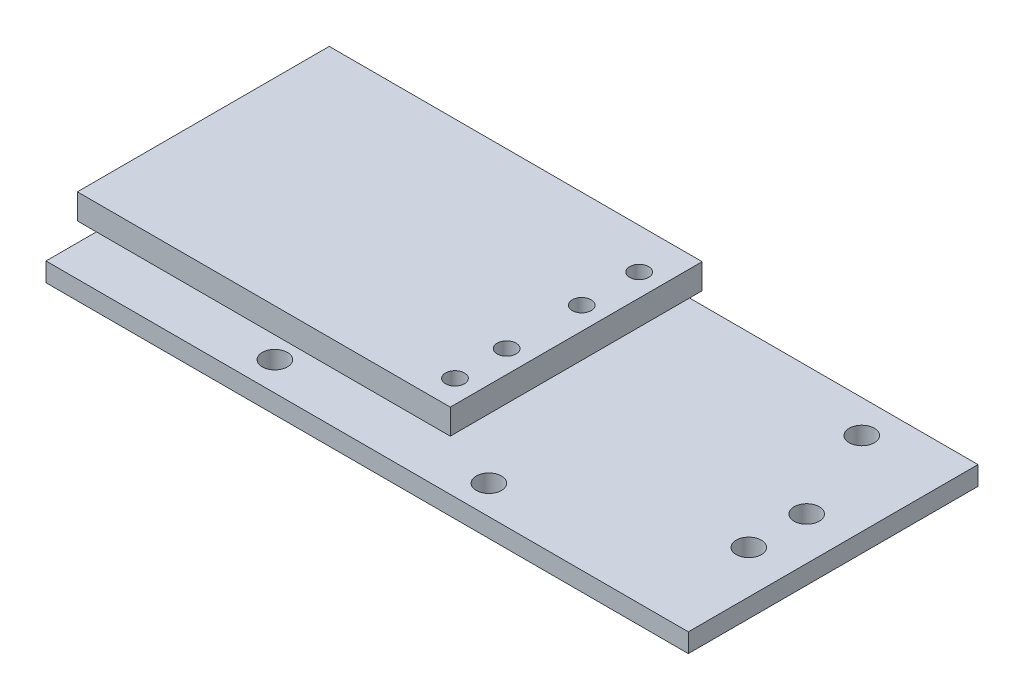
ISO-10303-21;
HEADER;
FILE_DESCRIPTION(('STEP AP214'),'2;1');
FILE_NAME('part.step','',(''),(''),'','','');
FILE_SCHEMA(('AUTOMOTIVE_DESIGN { 1 0 10303 214 1 1 1 1 }'));
ENDSEC;
DATA;
#1=APPLICATION_CONTEXT('core data for automotive mechanical design processes');
#2=APPLICATION_PROTOCOL_DEFINITION('international standard','automotive_design',2000,#1);
#3=PRODUCT_CONTEXT('',#1,'mechanical');
#4=PRODUCT('Part','Part','',(#3));
#5=PRODUCT_RELATED_PRODUCT_CATEGORY('part','',(#4));
#6=PRODUCT_DEFINITION_FORMATION('','',#4);
#7=PRODUCT_DEFINITION_CONTEXT('part definition',#1,'design');
#8=PRODUCT_DEFINITION('design','',#6,#7);
#9=PRODUCT_DEFINITION_SHAPE('','',#8);
#10=(LENGTH_UNIT() NAMED_UNIT(*) SI_UNIT(.MILLI.,.METRE.));
#11=(NAMED_UNIT(*) PLANE_ANGLE_UNIT() SI_UNIT($,.RADIAN.));
#12=(NAMED_UNIT(*) SI_UNIT($,.STERADIAN.) SOLID_ANGLE_UNIT());
#13=UNCERTAINTY_MEASURE_WITH_UNIT(LENGTH_MEASURE(1.E-05),#10,'distance_accuracy_value','');
#14=(GEOMETRIC_REPRESENTATION_CONTEXT(3) GLOBAL_UNCERTAINTY_ASSIGNED_CONTEXT((#13)) GLOBAL_UNIT_ASSIGNED_CONTEXT((#10,
#11,#12)) REPRESENTATION_CONTEXT('',''));
#15=CARTESIAN_POINT('',(0.,0.,0.));
#16=DIRECTION('',(0.,0.,1.));
#17=DIRECTION('',(1.,0.,0.));
#18=AXIS2_PLACEMENT_3D('',#15,#16,#17);
#19=CARTESIAN_POINT('',(0.,1.5,0.));
#20=DIRECTION('',(0.,1.,0.));
#21=DIRECTION('',(0.,0.,1.));
#22=AXIS2_PLACEMENT_3D('',#19,#20,#21);
#23=PLANE('',#22);
#24=CARTESIAN_POINT('',(7.36400767289264,1.5,9.20036926936542));
#25=DIRECTION('',(0.,1.,0.));
#26=DIRECTION('',(0.,0.,1.));
#27=AXIS2_PLACEMENT_3D('',#24,#25,#26);
#28=CIRCLE('',#27,1.);
#29=CARTESIAN_POINT('',(7.36400767289264,1.5,10.2003692693654));
#30=VERTEX_POINT('',#29);
#31=EDGE_CURVE('E201',#30,#30,#28,.T.);
#32=ORIENTED_EDGE('',*,*,#31,.F.);
#33=EDGE_LOOP('',(#32));
#34=FACE_BOUND('',#33,.T.);
#35=CARTESIAN_POINT('',(22.0955755667116,1.5,3.29315640105188));
#36=DIRECTION('',(0.,1.,0.));
#37=DIRECTION('',(0.,0.,1.));
#38=AXIS2_PLACEMENT_3D('',#35,#36,#37);
#39=CIRCLE('',#38,1.);
#40=CARTESIAN_POINT('',(22.0955755667116,1.5,4.29315640105189));
#41=VERTEX_POINT('',#40);
#42=EDGE_CURVE('E213',#41,#41,#39,.T.);
#43=ORIENTED_EDGE('',*,*,#42,.F.);
#44=EDGE_LOOP('',(#43));
#45=FACE_BOUND('',#44,.T.);
#46=CARTESIAN_POINT('',(-18.598557526115,1.5,-8.88591210522416));
#47=DIRECTION('',(0.,1.,0.));
#48=DIRECTION('',(0.,0.,1.));
#49=AXIS2_PLACEMENT_3D('',#46,#47,#48);
#50=CIRCLE('',#49,0.499999999999999);
#51=CARTESIAN_POINT('',(-18.598557526115,1.5,-8.38591210522417));
#52=VERTEX_POINT('',#51);
#53=EDGE_CURVE('E225',#52,#52,#50,.T.);
#54=ORIENTED_EDGE('',*,*,#53,.F.);
#55=EDGE_LOOP('',(#54));
#56=FACE_BOUND('',#55,.T.);
#57=DIRECTION('',(0.,0.,1.));
#58=VECTOR('',#57,1.);
#59=CARTESIAN_POINT('',(-25.5,1.5,-11.5));
#60=LINE('',#59,#58);
#61=CARTESIAN_POINT('',(-25.5,1.5,-11.5));
#62=VERTEX_POINT('',#61);
#63=CARTESIAN_POINT('',(-25.5,1.5,11.5));
#64=VERTEX_POINT('',#63);
#65=EDGE_CURVE('E231',#62,#64,#60,.T.);
#66=ORIENTED_EDGE('',*,*,#65,.T.);
#67=DIRECTION('',(1.,0.,0.));
#68=VECTOR('',#67,1.);
#69=CARTESIAN_POINT('',(-25.5,1.5,11.5));
#70=LINE('',#69,#68);
#71=CARTESIAN_POINT('',(25.5,1.5,11.5));
#72=VERTEX_POINT('',#71);
#73=EDGE_CURVE('E88',#64,#72,#70,.T.);
#74=ORIENTED_EDGE('',*,*,#73,.T.);
#75=DIRECTION('',(0.,0.,-1.));
#76=VECTOR('',#75,1.);
#77=CARTESIAN_POINT('',(25.5,1.5,-11.5));
#78=LINE('',#77,#76);
#79=CARTESIAN_POINT('',(25.5,1.5,-11.5));
#80=VERTEX_POINT('',#79);
#81=EDGE_CURVE('E234',#72,#80,#78,.T.);
#82=ORIENTED_EDGE('',*,*,#81,.T.);
#83=DIRECTION('',(-1.,0.,0.));
#84=VECTOR('',#83,1.);
#85=CARTESIAN_POINT('',(-25.5,1.5,-11.5));
#86=LINE('',#85,#84);
#87=EDGE_CURVE('E60',#80,#62,#86,.T.);
#88=ORIENTED_EDGE('',*,*,#87,.T.);
#89=EDGE_LOOP('',(#66,#74,#82,#88));
#90=FACE_BOUND('',#89,.T.);
#91=CARTESIAN_POINT('',(18.8867191938005,1.5,-8.88591210522416));
#92=DIRECTION('',(0.,1.,0.));
#93=DIRECTION('',(0.,0.,1.));
#94=AXIS2_PLACEMENT_3D('',#91,#92,#93);
#95=CIRCLE('',#94,1.);
#96=CARTESIAN_POINT('',(18.8867191938005,1.5,-7.88591210522416));
#97=VERTEX_POINT('',#96);
#98=EDGE_CURVE('E219',#97,#97,#95,.T.);
#99=ORIENTED_EDGE('',*,*,#98,.F.);
#100=EDGE_LOOP('',(#99));
#101=FACE_BOUND('',#100,.T.);
#102=CARTESIAN_POINT('',(22.0955755667116,1.5,-1.3013424965253));
#103=DIRECTION('',(0.,1.,0.));
#104=DIRECTION('',(0.,0.,1.));
#105=AXIS2_PLACEMENT_3D('',#102,#103,#104);
#106=CIRCLE('',#105,1.);
#107=CARTESIAN_POINT('',(22.0955755667116,1.5,-0.301342496525302));
#108=VERTEX_POINT('',#107);
#109=EDGE_CURVE('E207',#108,#108,#106,.T.);
#110=ORIENTED_EDGE('',*,*,#109,.F.);
#111=EDGE_LOOP('',(#110));
#112=FACE_BOUND('',#111,.T.);
#113=CARTESIAN_POINT('',(-9.62834539275,1.5,9.20036926936542));
#114=DIRECTION('',(0.,1.,0.));
#115=DIRECTION('',(0.,0.,1.));
#116=AXIS2_PLACEMENT_3D('',#113,#114,#115);
#117=CIRCLE('',#116,1.);
#118=CARTESIAN_POINT('',(-9.62834539275,1.5,10.2003692693654));
#119=VERTEX_POINT('',#118);
#120=EDGE_CURVE('E195',#119,#119,#117,.T.);
#121=ORIENTED_EDGE('',*,*,#120,.F.);
#122=EDGE_LOOP('',(#121));
#123=FACE_BOUND('',#122,.T.);
#124=DIRECTION('',(-1.,0.,0.));
#125=VECTOR('',#124,1.);
#126=CARTESIAN_POINT('',(-4.03174944560538,1.5,-6.78909533081827));
#127=LINE('',#126,#125);
#128=CARTESIAN_POINT('',(-4.03174944560538,1.5,-6.78909533081827));
#129=VERTEX_POINT('',#128);
#130=CARTESIAN_POINT('',(-22.2904768199562,1.5,-6.78909533081827));
#131=VERTEX_POINT('',#130);
#132=EDGE_CURVE('E162',#129,#131,#127,.T.);
#133=ORIENTED_EDGE('',*,*,#132,.F.);
#134=DIRECTION('',(0.,0.,-1.));
#135=VECTOR('',#134,1.);
#136=CARTESIAN_POINT('',(-4.03174944560538,1.5,6.78909533081827));
#137=LINE('',#136,#135);
#138=CARTESIAN_POINT('',(-4.03174944560538,1.5,6.78909533081827));
#139=VERTEX_POINT('',#138);
#140=EDGE_CURVE('E159',#139,#129,#137,.T.);
#141=ORIENTED_EDGE('',*,*,#140,.F.);
#142=DIRECTION('',(1.,0.,0.));
#143=VECTOR('',#142,1.);
#144=CARTESIAN_POINT('',(-4.03174944560538,1.5,6.78909533081827));
#145=LINE('',#144,#143);
#146=CARTESIAN_POINT('',(-22.2904768199562,1.5,6.78909533081827));
#147=VERTEX_POINT('',#146);
#148=EDGE_CURVE('E172',#147,#139,#145,.T.);
#149=ORIENTED_EDGE('',*,*,#148,.F.);
#150=DIRECTION('',(0.,0.,1.));
#151=VECTOR('',#150,1.);
#152=CARTESIAN_POINT('',(-22.2904768199562,1.5,6.78909533081827));
#153=LINE('',#152,#151);
#154=EDGE_CURVE('E183',#131,#147,#153,.T.);
#155=ORIENTED_EDGE('',*,*,#154,.F.);
#156=EDGE_LOOP('',(#133,#141,#149,#155));
#157=FACE_BOUND('',#156,.T.);
#158=ADVANCED_FACE('F36',(#34,#45,#56,#90,#101,#112,#123,#157),#23,.T.);
#159=CARTESIAN_POINT('',(0.,0.,0.));
#160=DIRECTION('',(0.,1.,0.));
#161=DIRECTION('',(0.,0.,1.));
#162=AXIS2_PLACEMENT_3D('',#159,#160,#161);
#163=PLANE('',#162);
#164=DIRECTION('',(0.,0.,1.));
#165=VECTOR('',#164,1.);
#166=CARTESIAN_POINT('',(-25.5,0.,-11.5));
#167=LINE('',#166,#165);
#168=CARTESIAN_POINT('',(-25.5,0.,-11.5));
#169=VERTEX_POINT('',#168);
#170=CARTESIAN_POINT('',(-25.5,0.,11.5));
#171=VERTEX_POINT('',#170);
#172=EDGE_CURVE('E228',#169,#171,#167,.T.);
#173=ORIENTED_EDGE('',*,*,#172,.F.);
#174=DIRECTION('',(-1.,0.,0.));
#175=VECTOR('',#174,1.);
#176=CARTESIAN_POINT('',(-25.5,0.,-11.5));
#177=LINE('',#176,#175);
#178=CARTESIAN_POINT('',(25.5,0.,-11.5));
#179=VERTEX_POINT('',#178);
#180=EDGE_CURVE('E81',#179,#169,#177,.T.);
#181=ORIENTED_EDGE('',*,*,#180,.F.);
#182=DIRECTION('',(0.,0.,-1.));
#183=VECTOR('',#182,1.);
#184=CARTESIAN_POINT('',(25.5,0.,-11.5));
#185=LINE('',#184,#183);
#186=CARTESIAN_POINT('',(25.5,0.,11.5));
#187=VERTEX_POINT('',#186);
#188=EDGE_CURVE('E242',#187,#179,#185,.T.);
#189=ORIENTED_EDGE('',*,*,#188,.F.);
#190=DIRECTION('',(1.,0.,0.));
#191=VECTOR('',#190,1.);
#192=CARTESIAN_POINT('',(-25.5,0.,11.5));
#193=LINE('',#192,#191);
#194=EDGE_CURVE('E240',#171,#187,#193,.T.);
#195=ORIENTED_EDGE('',*,*,#194,.F.);
#196=EDGE_LOOP('',(#173,#181,#189,#195));
#197=FACE_BOUND('',#196,.T.);
#198=CARTESIAN_POINT('',(-18.598557526115,0.,-8.88591210522416));
#199=DIRECTION('',(0.,1.,0.));
#200=DIRECTION('',(0.,0.,1.));
#201=AXIS2_PLACEMENT_3D('',#198,#199,#200);
#202=CIRCLE('',#201,0.499999999999999);
#203=CARTESIAN_POINT('',(-18.598557526115,0.,-8.38591210522417));
#204=VERTEX_POINT('',#203);
#205=EDGE_CURVE('E222',#204,#204,#202,.T.);
#206=ORIENTED_EDGE('',*,*,#205,.T.);
#207=EDGE_LOOP('',(#206));
#208=FACE_BOUND('',#207,.T.);
#209=CARTESIAN_POINT('',(18.8867191938005,0.,-8.88591210522416));
#210=DIRECTION('',(0.,1.,0.));
#211=DIRECTION('',(0.,0.,1.));
#212=AXIS2_PLACEMENT_3D('',#209,#210,#211);
#213=CIRCLE('',#212,1.);
#214=CARTESIAN_POINT('',(18.8867191938005,0.,-7.88591210522416));
#215=VERTEX_POINT('',#214);
#216=EDGE_CURVE('E216',#215,#215,#213,.T.);
#217=ORIENTED_EDGE('',*,*,#216,.T.);
#218=EDGE_LOOP('',(#217));
#219=FACE_BOUND('',#218,.T.);
#220=CARTESIAN_POINT('',(22.0955755667116,0.,3.29315640105188));
#221=DIRECTION('',(0.,1.,0.));
#222=DIRECTION('',(0.,0.,1.));
#223=AXIS2_PLACEMENT_3D('',#220,#221,#222);
#224=CIRCLE('',#223,1.);
#225=CARTESIAN_POINT('',(22.0955755667116,0.,4.29315640105189));
#226=VERTEX_POINT('',#225);
#227=EDGE_CURVE('E210',#226,#226,#224,.T.);
#228=ORIENTED_EDGE('',*,*,#227,.T.);
#229=EDGE_LOOP('',(#228));
#230=FACE_BOUND('',#229,.T.);
#231=CARTESIAN_POINT('',(22.0955755667116,0.,-1.3013424965253));
#232=DIRECTION('',(0.,1.,0.));
#233=DIRECTION('',(0.,0.,1.));
#234=AXIS2_PLACEMENT_3D('',#231,#232,#233);
#235=CIRCLE('',#234,1.);
#236=CARTESIAN_POINT('',(22.0955755667116,0.,-0.301342496525302));
#237=VERTEX_POINT('',#236);
#238=EDGE_CURVE('E204',#237,#237,#235,.T.);
#239=ORIENTED_EDGE('',*,*,#238,.T.);
#240=EDGE_LOOP('',(#239));
#241=FACE_BOUND('',#240,.T.);
#242=CARTESIAN_POINT('',(7.36400767289264,0.,9.20036926936542));
#243=DIRECTION('',(0.,1.,0.));
#244=DIRECTION('',(0.,0.,1.));
#245=AXIS2_PLACEMENT_3D('',#242,#243,#244);
#246=CIRCLE('',#245,1.);
#247=CARTESIAN_POINT('',(7.36400767289264,0.,10.2003692693654));
#248=VERTEX_POINT('',#247);
#249=EDGE_CURVE('E198',#248,#248,#246,.T.);
#250=ORIENTED_EDGE('',*,*,#249,.T.);
#251=EDGE_LOOP('',(#250));
#252=FACE_BOUND('',#251,.T.);
#253=CARTESIAN_POINT('',(-9.62834539275,0.,9.20036926936542));
#254=DIRECTION('',(0.,1.,0.));
#255=DIRECTION('',(0.,0.,1.));
#256=AXIS2_PLACEMENT_3D('',#253,#254,#255);
#257=CIRCLE('',#256,1.);
#258=CARTESIAN_POINT('',(-9.62834539275,0.,10.2003692693654));
#259=VERTEX_POINT('',#258);
#260=EDGE_CURVE('E194',#259,#259,#257,.T.);
#261=ORIENTED_EDGE('',*,*,#260,.T.);
#262=EDGE_LOOP('',(#261));
#263=FACE_BOUND('',#262,.T.);
#264=ADVANCED_FACE('F255',(#197,#208,#219,#230,#241,#252,#263),#163,.F.);
#265=CARTESIAN_POINT('',(-25.5,1.5,-11.5));
#266=DIRECTION('',(1.,0.,0.));
#267=DIRECTION('',(0.,0.,-1.));
#268=AXIS2_PLACEMENT_3D('',#265,#266,#267);
#269=PLANE('',#268);
#270=ORIENTED_EDGE('',*,*,#172,.T.);
#271=DIRECTION('',(0.,-1.,0.));
#272=VECTOR('',#271,1.);
#273=CARTESIAN_POINT('',(-25.5,1.5,11.5));
#274=LINE('',#273,#272);
#275=EDGE_CURVE('E11',#64,#171,#274,.T.);
#276=ORIENTED_EDGE('',*,*,#275,.F.);
#277=ORIENTED_EDGE('',*,*,#65,.F.);
#278=DIRECTION('',(0.,-1.,0.));
#279=VECTOR('',#278,1.);
#280=CARTESIAN_POINT('',(-25.5,1.5,-11.5));
#281=LINE('',#280,#279);
#282=EDGE_CURVE('E237',#62,#169,#281,.T.);
#283=ORIENTED_EDGE('',*,*,#282,.T.);
#284=EDGE_LOOP('',(#270,#276,#277,#283));
#285=FACE_BOUND('',#284,.T.);
#286=ADVANCED_FACE('F38',(#285),#269,.F.);
#287=CARTESIAN_POINT('',(-25.5,1.5,11.5));
#288=DIRECTION('',(0.,0.,-1.));
#289=DIRECTION('',(-1.,0.,0.));
#290=AXIS2_PLACEMENT_3D('',#287,#288,#289);
#291=PLANE('',#290);
#292=ORIENTED_EDGE('',*,*,#194,.T.);
#293=DIRECTION('',(0.,-1.,0.));
#294=VECTOR('',#293,1.);
#295=CARTESIAN_POINT('',(25.5,1.5,11.5));
#296=LINE('',#295,#294);
#297=EDGE_CURVE('E44',#72,#187,#296,.T.);
#298=ORIENTED_EDGE('',*,*,#297,.F.);
#299=ORIENTED_EDGE('',*,*,#73,.F.);
#300=ORIENTED_EDGE('',*,*,#275,.T.);
#301=EDGE_LOOP('',(#292,#298,#299,#300));
#302=FACE_BOUND('',#301,.T.);
#303=ADVANCED_FACE('F271',(#302),#291,.F.);
#304=CARTESIAN_POINT('',(25.5,1.5,-11.5));
#305=DIRECTION('',(-1.,0.,0.));
#306=DIRECTION('',(0.,0.,1.));
#307=AXIS2_PLACEMENT_3D('',#304,#305,#306);
#308=PLANE('',#307);
#309=ORIENTED_EDGE('',*,*,#188,.T.);
#310=DIRECTION('',(0.,-1.,0.));
#311=VECTOR('',#310,1.);
#312=CARTESIAN_POINT('',(25.5,1.5,-11.5));
#313=LINE('',#312,#311);
#314=EDGE_CURVE('E246',#80,#179,#313,.T.);
#315=ORIENTED_EDGE('',*,*,#314,.F.);
#316=ORIENTED_EDGE('',*,*,#81,.F.);
#317=ORIENTED_EDGE('',*,*,#297,.T.);
#318=EDGE_LOOP('',(#309,#315,#316,#317));
#319=FACE_BOUND('',#318,.T.);
#320=ADVANCED_FACE('F251',(#319),#308,.F.);
#321=CARTESIAN_POINT('',(-25.5,1.5,-11.5));
#322=DIRECTION('',(0.,0.,1.));
#323=DIRECTION('',(1.,0.,0.));
#324=AXIS2_PLACEMENT_3D('',#321,#322,#323);
#325=PLANE('',#324);
#326=ORIENTED_EDGE('',*,*,#180,.T.);
#327=ORIENTED_EDGE('',*,*,#282,.F.);
#328=ORIENTED_EDGE('',*,*,#87,.F.);
#329=ORIENTED_EDGE('',*,*,#314,.T.);
#330=EDGE_LOOP('',(#326,#327,#328,#329));
#331=FACE_BOUND('',#330,.T.);
#332=ADVANCED_FACE('F260',(#331),#325,.F.);
#333=CARTESIAN_POINT('',(-18.598557526115,1.5,-8.88591210522416));
#334=DIRECTION('',(0.,-1.,0.));
#335=DIRECTION('',(0.,0.,-1.));
#336=AXIS2_PLACEMENT_3D('',#333,#334,#335);
#337=CYLINDRICAL_SURFACE('',#336,0.499999999999999);
#338=ORIENTED_EDGE('',*,*,#53,.T.);
#339=EDGE_LOOP('',(#338));
#340=FACE_BOUND('',#339,.T.);
#341=ORIENTED_EDGE('',*,*,#205,.F.);
#342=EDGE_LOOP('',(#341));
#343=FACE_BOUND('',#342,.T.);
#344=ADVANCED_FACE('F262',(#340,#343),#337,.F.);
#345=CARTESIAN_POINT('',(18.8867191938005,1.5,-8.88591210522416));
#346=DIRECTION('',(0.,-1.,0.));
#347=DIRECTION('',(0.,0.,-1.));
#348=AXIS2_PLACEMENT_3D('',#345,#346,#347);
#349=CYLINDRICAL_SURFACE('',#348,1.);
#350=ORIENTED_EDGE('',*,*,#98,.T.);
#351=EDGE_LOOP('',(#350));
#352=FACE_BOUND('',#351,.T.);
#353=ORIENTED_EDGE('',*,*,#216,.F.);
#354=EDGE_LOOP('',(#353));
#355=FACE_BOUND('',#354,.T.);
#356=ADVANCED_FACE('F268',(#352,#355),#349,.F.);
#357=CARTESIAN_POINT('',(22.0955755667116,1.5,3.29315640105188));
#358=DIRECTION('',(0.,-1.,0.));
#359=DIRECTION('',(0.,0.,-1.));
#360=AXIS2_PLACEMENT_3D('',#357,#358,#359);
#361=CYLINDRICAL_SURFACE('',#360,1.);
#362=ORIENTED_EDGE('',*,*,#42,.T.);
#363=EDGE_LOOP('',(#362));
#364=FACE_BOUND('',#363,.T.);
#365=ORIENTED_EDGE('',*,*,#227,.F.);
#366=EDGE_LOOP('',(#365));
#367=FACE_BOUND('',#366,.T.);
#368=ADVANCED_FACE('F285',(#364,#367),#361,.F.);
#369=CARTESIAN_POINT('',(22.0955755667116,1.5,-1.3013424965253));
#370=DIRECTION('',(0.,-1.,0.));
#371=DIRECTION('',(0.,0.,-1.));
#372=AXIS2_PLACEMENT_3D('',#369,#370,#371);
#373=CYLINDRICAL_SURFACE('',#372,1.);
#374=ORIENTED_EDGE('',*,*,#109,.T.);
#375=EDGE_LOOP('',(#374));
#376=FACE_BOUND('',#375,.T.);
#377=ORIENTED_EDGE('',*,*,#238,.F.);
#378=EDGE_LOOP('',(#377));
#379=FACE_BOUND('',#378,.T.);
#380=ADVANCED_FACE('F289',(#376,#379),#373,.F.);
#381=CARTESIAN_POINT('',(7.36400767289264,1.5,9.20036926936542));
#382=DIRECTION('',(0.,-1.,0.));
#383=DIRECTION('',(0.,0.,-1.));
#384=AXIS2_PLACEMENT_3D('',#381,#382,#383);
#385=CYLINDRICAL_SURFACE('',#384,1.);
#386=ORIENTED_EDGE('',*,*,#31,.T.);
#387=EDGE_LOOP('',(#386));
#388=FACE_BOUND('',#387,.T.);
#389=ORIENTED_EDGE('',*,*,#249,.F.);
#390=EDGE_LOOP('',(#389));
#391=FACE_BOUND('',#390,.T.);
#392=ADVANCED_FACE('F293',(#388,#391),#385,.F.);
#393=CARTESIAN_POINT('',(-9.62834539275,1.5,9.20036926936542));
#394=DIRECTION('',(0.,-1.,0.));
#395=DIRECTION('',(0.,0.,-1.));
#396=AXIS2_PLACEMENT_3D('',#393,#394,#395);
#397=CYLINDRICAL_SURFACE('',#396,1.);
#398=ORIENTED_EDGE('',*,*,#120,.T.);
#399=EDGE_LOOP('',(#398));
#400=FACE_BOUND('',#399,.T.);
#401=ORIENTED_EDGE('',*,*,#260,.F.);
#402=EDGE_LOOP('',(#401));
#403=FACE_BOUND('',#402,.T.);
#404=ADVANCED_FACE('F297',(#400,#403),#397,.F.);
#405=CARTESIAN_POINT('',(-4.03174944560538,4.,6.78909533081827));
#406=DIRECTION('',(-1.,0.,0.));
#407=DIRECTION('',(0.,0.,1.));
#408=AXIS2_PLACEMENT_3D('',#405,#406,#407);
#409=PLANE('',#408);
#410=ORIENTED_EDGE('',*,*,#140,.T.);
#411=DIRECTION('',(0.,-1.,0.));
#412=VECTOR('',#411,1.);
#413=CARTESIAN_POINT('',(-4.03174944560538,4.,-6.78909533081827));
#414=LINE('',#413,#412);
#415=CARTESIAN_POINT('',(-4.03174944560538,4.,-6.78909533081827));
#416=VERTEX_POINT('',#415);
#417=EDGE_CURVE('E192',#416,#129,#414,.T.);
#418=ORIENTED_EDGE('',*,*,#417,.F.);
#419=DIRECTION('',(0.,0.,-1.));
#420=VECTOR('',#419,1.);
#421=CARTESIAN_POINT('',(-4.03174944560538,4.,6.78909533081827));
#422=LINE('',#421,#420);
#423=CARTESIAN_POINT('',(-4.03174944560538,4.,6.78909533081827));
#424=VERTEX_POINT('',#423);
#425=EDGE_CURVE('E168',#424,#416,#422,.T.);
#426=ORIENTED_EDGE('',*,*,#425,.F.);
#427=DIRECTION('',(0.,-1.,0.));
#428=VECTOR('',#427,1.);
#429=CARTESIAN_POINT('',(-4.03174944560538,4.,6.78909533081827));
#430=LINE('',#429,#428);
#431=EDGE_CURVE('E180',#424,#139,#430,.T.);
#432=ORIENTED_EDGE('',*,*,#431,.T.);
#433=EDGE_LOOP('',(#410,#418,#426,#432));
#434=FACE_BOUND('',#433,.T.);
#435=ADVANCED_FACE('F301',(#434),#409,.F.);
#436=CARTESIAN_POINT('',(-4.03174944560538,4.,-6.78909533081827));
#437=DIRECTION('',(0.,0.,1.));
#438=DIRECTION('',(1.,0.,0.));
#439=AXIS2_PLACEMENT_3D('',#436,#437,#438);
#440=PLANE('',#439);
#441=ORIENTED_EDGE('',*,*,#132,.T.);
#442=DIRECTION('',(0.,-1.,0.));
#443=VECTOR('',#442,1.);
#444=CARTESIAN_POINT('',(-22.2904768199562,4.,-6.78909533081827));
#445=LINE('',#444,#443);
#446=CARTESIAN_POINT('',(-22.2904768199562,4.,-6.78909533081827));
#447=VERTEX_POINT('',#446);
#448=EDGE_CURVE('E189',#447,#131,#445,.T.);
#449=ORIENTED_EDGE('',*,*,#448,.F.);
#450=DIRECTION('',(-1.,0.,0.));
#451=VECTOR('',#450,1.);
#452=CARTESIAN_POINT('',(-4.03174944560538,4.,-6.78909533081827));
#453=LINE('',#452,#451);
#454=EDGE_CURVE('E171',#416,#447,#453,.T.);
#455=ORIENTED_EDGE('',*,*,#454,.F.);
#456=ORIENTED_EDGE('',*,*,#417,.T.);
#457=EDGE_LOOP('',(#441,#449,#455,#456));
#458=FACE_BOUND('',#457,.T.);
#459=ADVANCED_FACE('F305',(#458),#440,.F.);
#460=CARTESIAN_POINT('',(-22.2904768199562,4.,6.78909533081827));
#461=DIRECTION('',(1.,0.,0.));
#462=DIRECTION('',(0.,0.,-1.));
#463=AXIS2_PLACEMENT_3D('',#460,#461,#462);
#464=PLANE('',#463);
#465=ORIENTED_EDGE('',*,*,#154,.T.);
#466=DIRECTION('',(0.,-1.,0.));
#467=VECTOR('',#466,1.);
#468=CARTESIAN_POINT('',(-22.2904768199562,4.,6.78909533081827));
#469=LINE('',#468,#467);
#470=CARTESIAN_POINT('',(-22.2904768199562,4.,6.78909533081827));
#471=VERTEX_POINT('',#470);
#472=EDGE_CURVE('E51',#471,#147,#469,.T.);
#473=ORIENTED_EDGE('',*,*,#472,.F.);
#474=DIRECTION('',(0.,0.,1.));
#475=VECTOR('',#474,1.);
#476=CARTESIAN_POINT('',(-22.2904768199562,4.,6.78909533081827));
#477=LINE('',#476,#475);
#478=EDGE_CURVE('E175',#447,#471,#477,.T.);
#479=ORIENTED_EDGE('',*,*,#478,.F.);
#480=ORIENTED_EDGE('',*,*,#448,.T.);
#481=EDGE_LOOP('',(#465,#473,#479,#480));
#482=FACE_BOUND('',#481,.T.);
#483=ADVANCED_FACE('F309',(#482),#464,.F.);
#484=CARTESIAN_POINT('',(-4.03174944560538,4.,6.78909533081827));
#485=DIRECTION('',(0.,0.,-1.));
#486=DIRECTION('',(-1.,0.,0.));
#487=AXIS2_PLACEMENT_3D('',#484,#485,#486);
#488=PLANE('',#487);
#489=ORIENTED_EDGE('',*,*,#148,.T.);
#490=ORIENTED_EDGE('',*,*,#431,.F.);
#491=DIRECTION('',(1.,0.,0.));
#492=VECTOR('',#491,1.);
#493=CARTESIAN_POINT('',(-4.03174944560538,4.,6.78909533081827));
#494=LINE('',#493,#492);
#495=EDGE_CURVE('E178',#471,#424,#494,.T.);
#496=ORIENTED_EDGE('',*,*,#495,.F.);
#497=ORIENTED_EDGE('',*,*,#472,.T.);
#498=EDGE_LOOP('',(#489,#490,#496,#497));
#499=FACE_BOUND('',#498,.T.);
#500=ADVANCED_FACE('F313',(#499),#488,.F.);
#501=CARTESIAN_POINT('',(0.,4.,0.));
#502=DIRECTION('',(0.,1.,0.));
#503=DIRECTION('',(0.,0.,1.));
#504=AXIS2_PLACEMENT_3D('',#501,#502,#503);
#505=PLANE('',#504);
#506=CARTESIAN_POINT('',(3.3082098163672,4.,-6.78909533081827));
#507=DIRECTION('',(0.,1.,0.));
#508=DIRECTION('',(0.,0.,1.));
#509=AXIS2_PLACEMENT_3D('',#506,#507,#508);
#510=CIRCLE('',#509,0.75);
#511=CARTESIAN_POINT('',(3.3082098163672,4.,-6.03909533081827));
#512=VERTEX_POINT('',#511);
#513=EDGE_CURVE('E374',#512,#512,#510,.T.);
#514=ORIENTED_EDGE('',*,*,#513,.T.);
#515=EDGE_LOOP('',(#514));
#516=FACE_BOUND('',#515,.T.);
#517=CARTESIAN_POINT('',(3.3082098163672,4.,-2.22678189139458));
#518=DIRECTION('',(0.,1.,0.));
#519=DIRECTION('',(0.,0.,1.));
#520=AXIS2_PLACEMENT_3D('',#517,#518,#519);
#521=CIRCLE('',#520,0.75);
#522=CARTESIAN_POINT('',(3.3082098163672,4.,-1.47678189139458));
#523=VERTEX_POINT('',#522);
#524=EDGE_CURVE('E377',#523,#523,#521,.T.);
#525=ORIENTED_EDGE('',*,*,#524,.T.);
#526=EDGE_LOOP('',(#525));
#527=FACE_BOUND('',#526,.T.);
#528=CARTESIAN_POINT('',(3.3082098163672,4.,3.73359391497985));
#529=DIRECTION('',(0.,1.,0.));
#530=DIRECTION('',(0.,0.,1.));
#531=AXIS2_PLACEMENT_3D('',#528,#529,#530);
#532=CIRCLE('',#531,0.75);
#533=CARTESIAN_POINT('',(3.3082098163672,4.,4.48359391497985));
#534=VERTEX_POINT('',#533);
#535=EDGE_CURVE('E380',#534,#534,#532,.T.);
#536=ORIENTED_EDGE('',*,*,#535,.T.);
#537=EDGE_LOOP('',(#536));
#538=FACE_BOUND('',#537,.T.);
#539=CARTESIAN_POINT('',(3.3082098163672,4.,7.83684605629276));
#540=DIRECTION('',(0.,1.,0.));
#541=DIRECTION('',(0.,0.,1.));
#542=AXIS2_PLACEMENT_3D('',#539,#540,#541);
#543=CIRCLE('',#542,0.75);
#544=CARTESIAN_POINT('',(3.3082098163672,4.,8.58684605629276));
#545=VERTEX_POINT('',#544);
#546=EDGE_CURVE('E383',#545,#545,#543,.T.);
#547=ORIENTED_EDGE('',*,*,#546,.T.);
#548=EDGE_LOOP('',(#547));
#549=FACE_BOUND('',#548,.T.);
#550=DIRECTION('',(0.,0.,-1.));
#551=VECTOR('',#550,1.);
#552=CARTESIAN_POINT('',(5.09761424157004,4.,0.));
#553=LINE('',#552,#551);
#554=CARTESIAN_POINT('',(5.09761424157004,4.,10.));
#555=VERTEX_POINT('',#554);
#556=CARTESIAN_POINT('',(5.09761424157004,4.,-10.));
#557=VERTEX_POINT('',#556);
#558=EDGE_CURVE('E158',#555,#557,#553,.T.);
#559=ORIENTED_EDGE('',*,*,#558,.F.);
#560=DIRECTION('',(-1.,0.,0.));
#561=VECTOR('',#560,1.);
#562=CARTESIAN_POINT('',(0.,4.,10.));
#563=LINE('',#562,#561);
#564=CARTESIAN_POINT('',(-24.5111328519719,4.,10.));
#565=VERTEX_POINT('',#564);
#566=EDGE_CURVE('E392',#555,#565,#563,.T.);
#567=ORIENTED_EDGE('',*,*,#566,.T.);
#568=DIRECTION('',(0.,0.,-1.));
#569=VECTOR('',#568,1.);
#570=CARTESIAN_POINT('',(-24.5111328519719,4.,0.));
#571=LINE('',#570,#569);
#572=CARTESIAN_POINT('',(-24.5111328519719,4.,-9.99999999999999));
#573=VERTEX_POINT('',#572);
#574=EDGE_CURVE('E389',#565,#573,#571,.T.);
#575=ORIENTED_EDGE('',*,*,#574,.T.);
#576=DIRECTION('',(-1.,0.,0.));
#577=VECTOR('',#576,1.);
#578=CARTESIAN_POINT('',(0.,4.,-10.));
#579=LINE('',#578,#577);
#580=EDGE_CURVE('E387',#557,#573,#579,.T.);
#581=ORIENTED_EDGE('',*,*,#580,.F.);
#582=EDGE_LOOP('',(#559,#567,#575,#581));
#583=FACE_BOUND('',#582,.T.);
#584=ORIENTED_EDGE('',*,*,#495,.T.);
#585=ORIENTED_EDGE('',*,*,#425,.T.);
#586=ORIENTED_EDGE('',*,*,#454,.T.);
#587=ORIENTED_EDGE('',*,*,#478,.T.);
#588=EDGE_LOOP('',(#584,#585,#586,#587));
#589=FACE_BOUND('',#588,.T.);
#590=ADVANCED_FACE('F317',(#516,#527,#538,#549,#583,#589),#505,.F.);
#591=CARTESIAN_POINT('',(5.09761424157004,6.,0.));
#592=DIRECTION('',(-1.,0.,0.));
#593=DIRECTION('',(0.,0.,1.));
#594=AXIS2_PLACEMENT_3D('',#591,#592,#593);
#595=PLANE('',#594);
#596=ORIENTED_EDGE('',*,*,#558,.T.);
#597=DIRECTION('',(0.,-1.,0.));
#598=VECTOR('',#597,1.);
#599=CARTESIAN_POINT('',(5.09761424157004,6.,-10.));
#600=LINE('',#599,#598);
#601=CARTESIAN_POINT('',(5.09761424157004,6.,-10.));
#602=VERTEX_POINT('',#601);
#603=EDGE_CURVE('E139',#602,#557,#600,.T.);
#604=ORIENTED_EDGE('',*,*,#603,.F.);
#605=DIRECTION('',(0.,0.,-1.));
#606=VECTOR('',#605,1.);
#607=CARTESIAN_POINT('',(5.09761424157004,6.,0.));
#608=LINE('',#607,#606);
#609=CARTESIAN_POINT('',(5.09761424157004,6.,10.));
#610=VERTEX_POINT('',#609);
#611=EDGE_CURVE('E146',#610,#602,#608,.T.);
#612=ORIENTED_EDGE('',*,*,#611,.F.);
#613=DIRECTION('',(0.,-1.,0.));
#614=VECTOR('',#613,1.);
#615=CARTESIAN_POINT('',(5.09761424157004,6.,10.));
#616=LINE('',#615,#614);
#617=EDGE_CURVE('E373',#610,#555,#616,.T.);
#618=ORIENTED_EDGE('',*,*,#617,.T.);
#619=EDGE_LOOP('',(#596,#604,#612,#618));
#620=FACE_BOUND('',#619,.T.);
#621=ADVANCED_FACE('F156',(#620),#595,.F.);
#622=CARTESIAN_POINT('',(0.,6.,-10.));
#623=DIRECTION('',(0.,0.,1.));
#624=DIRECTION('',(1.,0.,0.));
#625=AXIS2_PLACEMENT_3D('',#622,#623,#624);
#626=PLANE('',#625);
#627=ORIENTED_EDGE('',*,*,#580,.T.);
#628=DIRECTION('',(0.,-1.,0.));
#629=VECTOR('',#628,1.);
#630=CARTESIAN_POINT('',(-24.5111328519719,6.,-9.99999999999999));
#631=LINE('',#630,#629);
#632=CARTESIAN_POINT('',(-24.5111328519719,6.,-9.99999999999999));
#633=VERTEX_POINT('',#632);
#634=EDGE_CURVE('E141',#633,#573,#631,.T.);
#635=ORIENTED_EDGE('',*,*,#634,.F.);
#636=DIRECTION('',(-1.,0.,0.));
#637=VECTOR('',#636,1.);
#638=CARTESIAN_POINT('',(0.,6.,-10.));
#639=LINE('',#638,#637);
#640=EDGE_CURVE('E134',#602,#633,#639,.T.);
#641=ORIENTED_EDGE('',*,*,#640,.F.);
#642=ORIENTED_EDGE('',*,*,#603,.T.);
#643=EDGE_LOOP('',(#627,#635,#641,#642));
#644=FACE_BOUND('',#643,.T.);
#645=ADVANCED_FACE('F137',(#644),#626,.F.);
#646=CARTESIAN_POINT('',(-24.5111328519719,6.,0.));
#647=DIRECTION('',(-1.,0.,0.));
#648=DIRECTION('',(0.,0.,1.));
#649=AXIS2_PLACEMENT_3D('',#646,#647,#648);
#650=PLANE('',#649);
#651=ORIENTED_EDGE('',*,*,#574,.F.);
#652=DIRECTION('',(0.,-1.,0.));
#653=VECTOR('',#652,1.);
#654=CARTESIAN_POINT('',(-24.5111328519719,6.,10.));
#655=LINE('',#654,#653);
#656=CARTESIAN_POINT('',(-24.5111328519719,6.,10.));
#657=VERTEX_POINT('',#656);
#658=EDGE_CURVE('E164',#657,#565,#655,.T.);
#659=ORIENTED_EDGE('',*,*,#658,.F.);
#660=DIRECTION('',(0.,0.,-1.));
#661=VECTOR('',#660,1.);
#662=CARTESIAN_POINT('',(-24.5111328519719,6.,0.));
#663=LINE('',#662,#661);
#664=EDGE_CURVE('E145',#657,#633,#663,.T.);
#665=ORIENTED_EDGE('',*,*,#664,.T.);
#666=ORIENTED_EDGE('',*,*,#634,.T.);
#667=EDGE_LOOP('',(#651,#659,#665,#666));
#668=FACE_BOUND('',#667,.T.);
#669=ADVANCED_FACE('F334',(#668),#650,.T.);
#670=CARTESIAN_POINT('',(3.3082098163672,6.,7.83684605629276));
#671=DIRECTION('',(0.,-1.,0.));
#672=DIRECTION('',(0.,0.,-1.));
#673=AXIS2_PLACEMENT_3D('',#670,#671,#672);
#674=CYLINDRICAL_SURFACE('',#673,0.75);
#675=CARTESIAN_POINT('',(3.3082098163672,6.,7.83684605629276));
#676=DIRECTION('',(0.,1.,0.));
#677=DIRECTION('',(0.,0.,1.));
#678=AXIS2_PLACEMENT_3D('',#675,#676,#677);
#679=CIRCLE('',#678,0.75);
#680=CARTESIAN_POINT('',(3.3082098163672,6.,8.58684605629276));
#681=VERTEX_POINT('',#680);
#682=EDGE_CURVE('E154',#681,#681,#679,.T.);
#683=ORIENTED_EDGE('',*,*,#682,.T.);
#684=EDGE_LOOP('',(#683));
#685=FACE_BOUND('',#684,.T.);
#686=ORIENTED_EDGE('',*,*,#546,.F.);
#687=EDGE_LOOP('',(#686));
#688=FACE_BOUND('',#687,.T.);
#689=ADVANCED_FACE('F330',(#685,#688),#674,.F.);
#690=CARTESIAN_POINT('',(3.3082098163672,6.,3.73359391497985));
#691=DIRECTION('',(0.,-1.,0.));
#692=DIRECTION('',(0.,0.,-1.));
#693=AXIS2_PLACEMENT_3D('',#690,#691,#692);
#694=CYLINDRICAL_SURFACE('',#693,0.75);
#695=CARTESIAN_POINT('',(3.3082098163672,6.,3.73359391497985));
#696=DIRECTION('',(0.,1.,0.));
#697=DIRECTION('',(0.,0.,1.));
#698=AXIS2_PLACEMENT_3D('',#695,#696,#697);
#699=CIRCLE('',#698,0.75);
#700=CARTESIAN_POINT('',(3.3082098163672,6.,4.48359391497985));
#701=VERTEX_POINT('',#700);
#702=EDGE_CURVE('E364',#701,#701,#699,.T.);
#703=ORIENTED_EDGE('',*,*,#702,.T.);
#704=EDGE_LOOP('',(#703));
#705=FACE_BOUND('',#704,.T.);
#706=ORIENTED_EDGE('',*,*,#535,.F.);
#707=EDGE_LOOP('',(#706));
#708=FACE_BOUND('',#707,.T.);
#709=ADVANCED_FACE('F326',(#705,#708),#694,.F.);
#710=CARTESIAN_POINT('',(3.3082098163672,6.,-2.22678189139458));
#711=DIRECTION('',(0.,-1.,0.));
#712=DIRECTION('',(0.,0.,-1.));
#713=AXIS2_PLACEMENT_3D('',#710,#711,#712);
#714=CYLINDRICAL_SURFACE('',#713,0.75);
#715=CARTESIAN_POINT('',(3.3082098163672,6.,-2.22678189139458));
#716=DIRECTION('',(0.,1.,0.));
#717=DIRECTION('',(0.,0.,1.));
#718=AXIS2_PLACEMENT_3D('',#715,#716,#717);
#719=CIRCLE('',#718,0.75);
#720=CARTESIAN_POINT('',(3.3082098163672,6.,-1.47678189139458));
#721=VERTEX_POINT('',#720);
#722=EDGE_CURVE('E360',#721,#721,#719,.T.);
#723=ORIENTED_EDGE('',*,*,#722,.T.);
#724=EDGE_LOOP('',(#723));
#725=FACE_BOUND('',#724,.T.);
#726=ORIENTED_EDGE('',*,*,#524,.F.);
#727=EDGE_LOOP('',(#726));
#728=FACE_BOUND('',#727,.T.);
#729=ADVANCED_FACE('F322',(#725,#728),#714,.F.);
#730=CARTESIAN_POINT('',(3.3082098163672,6.,-6.78909533081827));
#731=DIRECTION('',(0.,-1.,0.));
#732=DIRECTION('',(0.,0.,-1.));
#733=AXIS2_PLACEMENT_3D('',#730,#731,#732);
#734=CYLINDRICAL_SURFACE('',#733,0.75);
#735=CARTESIAN_POINT('',(3.3082098163672,6.,-6.78909533081827));
#736=DIRECTION('',(0.,1.,0.));
#737=DIRECTION('',(0.,0.,1.));
#738=AXIS2_PLACEMENT_3D('',#735,#736,#737);
#739=CIRCLE('',#738,0.75);
#740=CARTESIAN_POINT('',(3.3082098163672,6.,-6.03909533081827));
#741=VERTEX_POINT('',#740);
#742=EDGE_CURVE('E356',#741,#741,#739,.T.);
#743=ORIENTED_EDGE('',*,*,#742,.T.);
#744=EDGE_LOOP('',(#743));
#745=FACE_BOUND('',#744,.T.);
#746=ORIENTED_EDGE('',*,*,#513,.F.);
#747=EDGE_LOOP('',(#746));
#748=FACE_BOUND('',#747,.T.);
#749=ADVANCED_FACE('F318',(#745,#748),#734,.F.);
#750=CARTESIAN_POINT('',(0.,6.,10.));
#751=DIRECTION('',(0.,0.,1.));
#752=DIRECTION('',(1.,0.,0.));
#753=AXIS2_PLACEMENT_3D('',#750,#751,#752);
#754=PLANE('',#753);
#755=ORIENTED_EDGE('',*,*,#566,.F.);
#756=ORIENTED_EDGE('',*,*,#617,.F.);
#757=DIRECTION('',(-1.,0.,0.));
#758=VECTOR('',#757,1.);
#759=CARTESIAN_POINT('',(0.,6.,10.));
#760=LINE('',#759,#758);
#761=EDGE_CURVE('E152',#610,#657,#760,.T.);
#762=ORIENTED_EDGE('',*,*,#761,.T.);
#763=ORIENTED_EDGE('',*,*,#658,.T.);
#764=EDGE_LOOP('',(#755,#756,#762,#763));
#765=FACE_BOUND('',#764,.T.);
#766=ADVANCED_FACE('F321',(#765),#754,.T.);
#767=CARTESIAN_POINT('',(0.,6.,0.));
#768=DIRECTION('',(0.,1.,0.));
#769=DIRECTION('',(0.,0.,1.));
#770=AXIS2_PLACEMENT_3D('',#767,#768,#769);
#771=PLANE('',#770);
#772=ORIENTED_EDGE('',*,*,#742,.F.);
#773=EDGE_LOOP('',(#772));
#774=FACE_BOUND('',#773,.T.);
#775=ORIENTED_EDGE('',*,*,#722,.F.);
#776=EDGE_LOOP('',(#775));
#777=FACE_BOUND('',#776,.T.);
#778=ORIENTED_EDGE('',*,*,#702,.F.);
#779=EDGE_LOOP('',(#778));
#780=FACE_BOUND('',#779,.T.);
#781=ORIENTED_EDGE('',*,*,#682,.F.);
#782=EDGE_LOOP('',(#781));
#783=FACE_BOUND('',#782,.T.);
#784=ORIENTED_EDGE('',*,*,#611,.T.);
#785=ORIENTED_EDGE('',*,*,#640,.T.);
#786=ORIENTED_EDGE('',*,*,#664,.F.);
#787=ORIENTED_EDGE('',*,*,#761,.F.);
#788=EDGE_LOOP('',(#784,#785,#786,#787));
#789=FACE_BOUND('',#788,.T.);
#790=ADVANCED_FACE('F150',(#774,#777,#780,#783,#789),#771,.T.);
#791=CLOSED_SHELL('',(#158,#264,#286,#303,#320,#332,#344,#356,#368,#380,#392,#404,#435,#459,
#483,#500,#590,#621,#645,#669,#689,#709,#729,#749,#766,#790));
#792=MANIFOLD_SOLID_BREP('B2',#791);
#793=ADVANCED_BREP_SHAPE_REPRESENTATION('',(#18,#792),#14);
#794=SHAPE_DEFINITION_REPRESENTATION(#9,#793);
ENDSEC;
END-ISO-10303-21;
